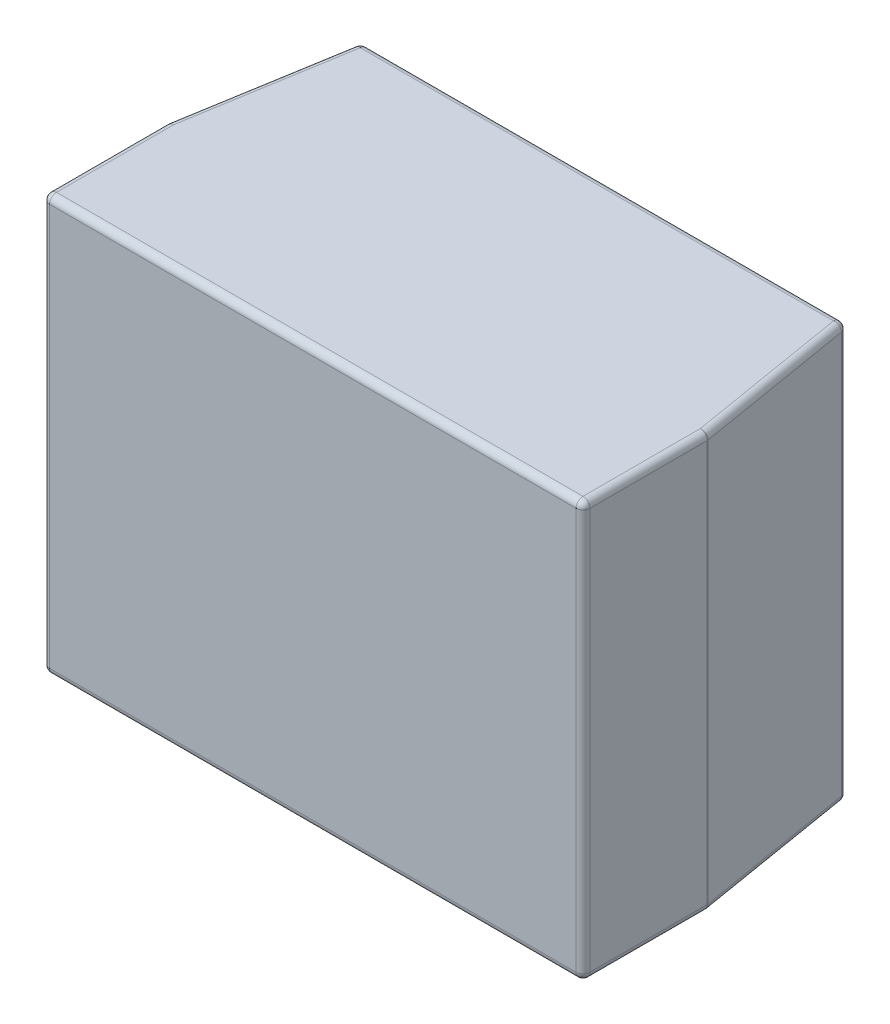
ISO-10303-21;
HEADER;
FILE_DESCRIPTION(('STEP AP214'),'2;1');
FILE_NAME('part.step','',(''),(''),'','','');
FILE_SCHEMA(('AUTOMOTIVE_DESIGN { 1 0 10303 214 1 1 1 1 }'));
ENDSEC;
DATA;
#1=APPLICATION_CONTEXT('core data for automotive mechanical design processes');
#2=APPLICATION_PROTOCOL_DEFINITION('international standard','automotive_design',2000,#1);
#3=PRODUCT_CONTEXT('',#1,'mechanical');
#4=PRODUCT('Part','Part','',(#3));
#5=PRODUCT_RELATED_PRODUCT_CATEGORY('part','',(#4));
#6=PRODUCT_DEFINITION_FORMATION('','',#4);
#7=PRODUCT_DEFINITION_CONTEXT('part definition',#1,'design');
#8=PRODUCT_DEFINITION('design','',#6,#7);
#9=PRODUCT_DEFINITION_SHAPE('','',#8);
#10=(LENGTH_UNIT() NAMED_UNIT(*) SI_UNIT(.MILLI.,.METRE.));
#11=(NAMED_UNIT(*) PLANE_ANGLE_UNIT() SI_UNIT($,.RADIAN.));
#12=(NAMED_UNIT(*) SI_UNIT($,.STERADIAN.) SOLID_ANGLE_UNIT());
#13=UNCERTAINTY_MEASURE_WITH_UNIT(LENGTH_MEASURE(1.E-05),#10,'distance_accuracy_value','');
#14=(GEOMETRIC_REPRESENTATION_CONTEXT(3) GLOBAL_UNCERTAINTY_ASSIGNED_CONTEXT((#13)) GLOBAL_UNIT_ASSIGNED_CONTEXT((#10,
#11,#12)) REPRESENTATION_CONTEXT('',''));
#15=CARTESIAN_POINT('',(0.,0.,0.));
#16=DIRECTION('',(0.,0.,1.));
#17=DIRECTION('',(1.,0.,0.));
#18=AXIS2_PLACEMENT_3D('',#15,#16,#17);
#19=CARTESIAN_POINT('',(0.,0.725,0.125));
#20=DIRECTION('',(-1.,0.,0.));
#21=DIRECTION('',(0.,-1.,0.));
#22=AXIS2_PLACEMENT_3D('',#19,#20,#21);
#23=CYLINDRICAL_SURFACE('',#22,0.025);
#24=CARTESIAN_POINT('',(-0.853821822790423,0.725,0.125));
#25=DIRECTION('',(1.,0.,0.));
#26=DIRECTION('',(0.,0.,1.));
#27=AXIS2_PLACEMENT_3D('',#24,#25,#26);
#28=CIRCLE('',#27,0.025);
#29=CARTESIAN_POINT('',(-0.853821822790423,0.725,0.1));
#30=VERTEX_POINT('',#29);
#31=CARTESIAN_POINT('',(-0.853821822790423,0.75,0.125));
#32=VERTEX_POINT('',#31);
#33=EDGE_CURVE('E27',#30,#32,#28,.T.);
#34=ORIENTED_EDGE('',*,*,#33,.T.);
#35=DIRECTION('',(-1.,0.,0.));
#36=VECTOR('',#35,1.);
#37=CARTESIAN_POINT('',(-0.875,0.75,0.125));
#38=LINE('',#37,#36);
#39=CARTESIAN_POINT('',(0.853821822790424,0.75,0.125));
#40=VERTEX_POINT('',#39);
#41=EDGE_CURVE('E387',#40,#32,#38,.T.);
#42=ORIENTED_EDGE('',*,*,#41,.F.);
#43=CARTESIAN_POINT('',(0.853821822790424,0.725,0.125));
#44=DIRECTION('',(-1.,0.,0.));
#45=DIRECTION('',(0.,1.,0.));
#46=AXIS2_PLACEMENT_3D('',#43,#44,#45);
#47=CIRCLE('',#46,0.025);
#48=CARTESIAN_POINT('',(0.853821822790424,0.725,0.1));
#49=VERTEX_POINT('',#48);
#50=EDGE_CURVE('E11',#40,#49,#47,.T.);
#51=ORIENTED_EDGE('',*,*,#50,.T.);
#52=DIRECTION('',(1.,0.,0.));
#53=VECTOR('',#52,1.);
#54=CARTESIAN_POINT('',(0.875,0.725,0.1));
#55=LINE('',#54,#53);
#56=EDGE_CURVE('E269',#30,#49,#55,.T.);
#57=ORIENTED_EDGE('',*,*,#56,.F.);
#58=EDGE_LOOP('',(#34,#42,#51,#57));
#59=FACE_BOUND('',#58,.T.);
#60=ADVANCED_FACE('F16',(#59),#23,.T.);
#61=CARTESIAN_POINT('',(0.853821822790424,0.725,0.125));
#62=DIRECTION('',(0.,1.,0.));
#63=DIRECTION('',(-1.,0.,0.));
#64=AXIS2_PLACEMENT_3D('',#61,#62,#63);
#65=SPHERICAL_SURFACE('',#64,0.025);
#66=CARTESIAN_POINT('',(0.853821822790424,0.725,0.125));
#67=DIRECTION('',(-0.164398987305357,0.,-0.986393923832144));
#68=DIRECTION('',(-0.986393923832144,0.,0.164398987305357));
#69=AXIS2_PLACEMENT_3D('',#66,#67,#68);
#70=CIRCLE('',#69,0.025);
#71=CARTESIAN_POINT('',(0.878481670886228,0.725,0.120890025317366));
#72=VERTEX_POINT('',#71);
#73=EDGE_CURVE('E361',#40,#72,#70,.T.);
#74=ORIENTED_EDGE('',*,*,#73,.T.);
#75=CARTESIAN_POINT('',(0.853821822790424,0.725,0.125));
#76=DIRECTION('',(0.,1.,0.));
#77=DIRECTION('',(0.,0.,1.));
#78=AXIS2_PLACEMENT_3D('',#75,#76,#77);
#79=CIRCLE('',#78,0.025);
#80=EDGE_CURVE('E358',#72,#49,#79,.T.);
#81=ORIENTED_EDGE('',*,*,#80,.T.);
#82=ORIENTED_EDGE('',*,*,#50,.F.);
#83=EDGE_LOOP('',(#74,#81,#82));
#84=FACE_BOUND('',#83,.T.);
#85=ADVANCED_FACE('F576',(#84),#65,.T.);
#86=CARTESIAN_POINT('',(-0.853821822790423,0.725,0.125));
#87=DIRECTION('',(0.,1.,0.));
#88=DIRECTION('',(-1.,0.,0.));
#89=AXIS2_PLACEMENT_3D('',#86,#87,#88);
#90=SPHERICAL_SURFACE('',#89,0.025);
#91=CARTESIAN_POINT('',(-0.853821822790423,0.725,0.125));
#92=DIRECTION('',(0.,1.,0.));
#93=DIRECTION('',(0.,0.,1.));
#94=AXIS2_PLACEMENT_3D('',#91,#92,#93);
#95=CIRCLE('',#94,0.025);
#96=CARTESIAN_POINT('',(-0.878481670886227,0.725,0.120890025317366));
#97=VERTEX_POINT('',#96);
#98=EDGE_CURVE('E362',#30,#97,#95,.T.);
#99=ORIENTED_EDGE('',*,*,#98,.T.);
#100=CARTESIAN_POINT('',(-0.853821822790423,0.725,0.125));
#101=DIRECTION('',(0.164398987305358,0.,-0.986393923832144));
#102=DIRECTION('',(-0.986393923832144,0.,-0.164398987305358));
#103=AXIS2_PLACEMENT_3D('',#100,#101,#102);
#104=CIRCLE('',#103,0.025);
#105=EDGE_CURVE('E383',#97,#32,#104,.T.);
#106=ORIENTED_EDGE('',*,*,#105,.T.);
#107=ORIENTED_EDGE('',*,*,#33,.F.);
#108=EDGE_LOOP('',(#99,#106,#107));
#109=FACE_BOUND('',#108,.T.);
#110=ADVANCED_FACE('F399',(#109),#90,.T.);
#111=CARTESIAN_POINT('',(0.996961773525818,0.725,0.983839704412364));
#112=DIRECTION('',(-0.164398987305357,0.,-0.986393923832144));
#113=DIRECTION('',(-0.986393923832144,0.,0.164398987305357));
#114=AXIS2_PLACEMENT_3D('',#111,#112,#113);
#115=CYLINDRICAL_SURFACE('',#114,0.025);
#116=CARTESIAN_POINT('',(0.95,0.725,0.702069063257455));
#117=DIRECTION('',(-0.164398987305358,0.,-0.986393923832144));
#118=DIRECTION('',(0.986393923832144,0.,-0.164398987305358));
#119=AXIS2_PLACEMENT_3D('',#116,#117,#118);
#120=CIRCLE('',#119,0.025);
#121=CARTESIAN_POINT('',(0.95,0.75,0.702069063257455));
#122=VERTEX_POINT('',#121);
#123=CARTESIAN_POINT('',(0.974659848095804,0.725,0.697959088574821));
#124=VERTEX_POINT('',#123);
#125=EDGE_CURVE('E161',#122,#124,#120,.T.);
#126=ORIENTED_EDGE('',*,*,#125,.T.);
#127=DIRECTION('',(0.164398987305357,0.,0.986393923832144));
#128=VECTOR('',#127,1.);
#129=CARTESIAN_POINT('',(0.875,0.725,0.1));
#130=LINE('',#129,#128);
#131=EDGE_CURVE('E283',#72,#124,#130,.T.);
#132=ORIENTED_EDGE('',*,*,#131,.F.);
#133=ORIENTED_EDGE('',*,*,#73,.F.);
#134=DIRECTION('',(-0.164398987305357,0.,-0.986393923832144));
#135=VECTOR('',#134,1.);
#136=CARTESIAN_POINT('',(0.996961773525818,0.75,0.983839704412364));
#137=LINE('',#136,#135);
#138=EDGE_CURVE('E392',#122,#40,#137,.T.);
#139=ORIENTED_EDGE('',*,*,#138,.F.);
#140=EDGE_LOOP('',(#126,#132,#133,#139));
#141=FACE_BOUND('',#140,.T.);
#142=ADVANCED_FACE('F589',(#141),#115,.T.);
#143=CARTESIAN_POINT('',(0.853821822790424,0.,0.125));
#144=DIRECTION('',(0.,1.,0.));
#145=DIRECTION('',(0.,0.,1.));
#146=AXIS2_PLACEMENT_3D('',#143,#144,#145);
#147=CYLINDRICAL_SURFACE('',#146,0.025);
#148=CARTESIAN_POINT('',(0.853821822790424,-0.725,0.125));
#149=DIRECTION('',(0.,1.,0.));
#150=DIRECTION('',(0.,0.,-1.));
#151=AXIS2_PLACEMENT_3D('',#148,#149,#150);
#152=CIRCLE('',#151,0.025);
#153=CARTESIAN_POINT('',(0.878481670886228,-0.725,0.120890025317366));
#154=VERTEX_POINT('',#153);
#155=CARTESIAN_POINT('',(0.853821822790424,-0.725,0.1));
#156=VERTEX_POINT('',#155);
#157=EDGE_CURVE('E445',#154,#156,#152,.T.);
#158=ORIENTED_EDGE('',*,*,#157,.T.);
#159=DIRECTION('',(0.,-1.,0.));
#160=VECTOR('',#159,1.);
#161=CARTESIAN_POINT('',(0.853821822790424,-0.75,0.1));
#162=LINE('',#161,#160);
#163=EDGE_CURVE('E272',#49,#156,#162,.T.);
#164=ORIENTED_EDGE('',*,*,#163,.F.);
#165=ORIENTED_EDGE('',*,*,#80,.F.);
#166=DIRECTION('',(0.,1.,0.));
#167=VECTOR('',#166,1.);
#168=CARTESIAN_POINT('',(0.878481670886228,0.75,0.120890025317366));
#169=LINE('',#168,#167);
#170=EDGE_CURVE('E279',#154,#72,#169,.T.);
#171=ORIENTED_EDGE('',*,*,#170,.F.);
#172=EDGE_LOOP('',(#158,#164,#165,#171));
#173=FACE_BOUND('',#172,.T.);
#174=ADVANCED_FACE('F586',(#173),#147,.T.);
#175=CARTESIAN_POINT('',(-0.853821822790423,0.,0.125));
#176=DIRECTION('',(0.,1.,0.));
#177=DIRECTION('',(0.,0.,1.));
#178=AXIS2_PLACEMENT_3D('',#175,#176,#177);
#179=CYLINDRICAL_SURFACE('',#178,0.025);
#180=CARTESIAN_POINT('',(-0.853821822790423,-0.725,0.125));
#181=DIRECTION('',(0.,1.,0.));
#182=DIRECTION('',(0.,0.,-1.));
#183=AXIS2_PLACEMENT_3D('',#180,#181,#182);
#184=CIRCLE('',#183,0.025);
#185=CARTESIAN_POINT('',(-0.853821822790423,-0.725,0.1));
#186=VERTEX_POINT('',#185);
#187=CARTESIAN_POINT('',(-0.878481670886227,-0.725,0.120890025317366));
#188=VERTEX_POINT('',#187);
#189=EDGE_CURVE('E410',#186,#188,#184,.T.);
#190=ORIENTED_EDGE('',*,*,#189,.T.);
#191=DIRECTION('',(0.,-1.,0.));
#192=VECTOR('',#191,1.);
#193=CARTESIAN_POINT('',(-0.878481670886227,-0.75,0.120890025317366));
#194=LINE('',#193,#192);
#195=EDGE_CURVE('E308',#97,#188,#194,.T.);
#196=ORIENTED_EDGE('',*,*,#195,.F.);
#197=ORIENTED_EDGE('',*,*,#98,.F.);
#198=DIRECTION('',(0.,1.,0.));
#199=VECTOR('',#198,1.);
#200=CARTESIAN_POINT('',(-0.853821822790423,0.75,0.1));
#201=LINE('',#200,#199);
#202=EDGE_CURVE('E245',#186,#30,#201,.T.);
#203=ORIENTED_EDGE('',*,*,#202,.F.);
#204=EDGE_LOOP('',(#190,#196,#197,#203));
#205=FACE_BOUND('',#204,.T.);
#206=ADVANCED_FACE('F409',(#205),#179,.T.);
#207=CARTESIAN_POINT('',(-0.996961773525817,0.725,0.983839704412364));
#208=DIRECTION('',(0.164398987305357,0.,-0.986393923832144));
#209=DIRECTION('',(-0.986393923832144,0.,-0.164398987305357));
#210=AXIS2_PLACEMENT_3D('',#207,#208,#209);
#211=CYLINDRICAL_SURFACE('',#210,0.025);
#212=CARTESIAN_POINT('',(-0.95,0.725,0.702069063257456));
#213=DIRECTION('',(0.164398987305383,0.,-0.98639392383214));
#214=DIRECTION('',(0.98639392383214,0.,0.164398987305383));
#215=AXIS2_PLACEMENT_3D('',#212,#213,#214);
#216=CIRCLE('',#215,0.025);
#217=CARTESIAN_POINT('',(-0.974659848095803,0.725,0.697959088574822));
#218=VERTEX_POINT('',#217);
#219=CARTESIAN_POINT('',(-0.95,0.75,0.702069063257456));
#220=VERTEX_POINT('',#219);
#221=EDGE_CURVE('E147',#218,#220,#216,.T.);
#222=ORIENTED_EDGE('',*,*,#221,.T.);
#223=DIRECTION('',(-0.164398987305357,0.,0.986393923832144));
#224=VECTOR('',#223,1.);
#225=CARTESIAN_POINT('',(-0.996961773525817,0.75,0.983839704412364));
#226=LINE('',#225,#224);
#227=EDGE_CURVE('E391',#32,#220,#226,.T.);
#228=ORIENTED_EDGE('',*,*,#227,.F.);
#229=ORIENTED_EDGE('',*,*,#105,.F.);
#230=DIRECTION('',(0.164398987305357,0.,-0.986393923832144));
#231=VECTOR('',#230,1.);
#232=CARTESIAN_POINT('',(-0.975,0.725,0.7));
#233=LINE('',#232,#231);
#234=EDGE_CURVE('E329',#218,#97,#233,.T.);
#235=ORIENTED_EDGE('',*,*,#234,.F.);
#236=EDGE_LOOP('',(#222,#228,#229,#235));
#237=FACE_BOUND('',#236,.T.);
#238=ADVANCED_FACE('F407',(#237),#211,.T.);
#239=CARTESIAN_POINT('',(0.95,0.725,0.702069063257456));
#240=DIRECTION('',(0.,1.,0.));
#241=DIRECTION('',(0.,0.,1.));
#242=AXIS2_PLACEMENT_3D('',#239,#240,#241);
#243=SPHERICAL_SURFACE('',#242,0.025);
#244=CARTESIAN_POINT('',(0.95,0.725,0.702069063257455));
#245=DIRECTION('',(0.,0.,-1.));
#246=DIRECTION('',(-1.,0.,0.));
#247=AXIS2_PLACEMENT_3D('',#244,#245,#246);
#248=CIRCLE('',#247,0.025);
#249=CARTESIAN_POINT('',(0.975,0.725,0.702069063257455));
#250=VERTEX_POINT('',#249);
#251=EDGE_CURVE('E259',#122,#250,#248,.T.);
#252=ORIENTED_EDGE('',*,*,#251,.T.);
#253=CARTESIAN_POINT('',(0.95,0.725,0.702069063257455));
#254=DIRECTION('',(0.,1.,0.));
#255=DIRECTION('',(0.,0.,1.));
#256=AXIS2_PLACEMENT_3D('',#253,#254,#255);
#257=CIRCLE('',#256,0.025);
#258=EDGE_CURVE('E454',#250,#124,#257,.T.);
#259=ORIENTED_EDGE('',*,*,#258,.T.);
#260=ORIENTED_EDGE('',*,*,#125,.F.);
#261=EDGE_LOOP('',(#252,#259,#260));
#262=FACE_BOUND('',#261,.T.);
#263=ADVANCED_FACE('F552',(#262),#243,.T.);
#264=CARTESIAN_POINT('',(0.853821822790424,-0.725,0.125));
#265=DIRECTION('',(0.,-1.,0.));
#266=DIRECTION('',(0.,0.,-1.));
#267=AXIS2_PLACEMENT_3D('',#264,#265,#266);
#268=SPHERICAL_SURFACE('',#267,0.025);
#269=CARTESIAN_POINT('',(0.853821822790424,-0.725,0.125));
#270=DIRECTION('',(-0.164398987305358,0.,-0.986393923832144));
#271=DIRECTION('',(-0.986393923832144,0.,0.164398987305358));
#272=AXIS2_PLACEMENT_3D('',#269,#270,#271);
#273=CIRCLE('',#272,0.025);
#274=CARTESIAN_POINT('',(0.853821822790424,-0.75,0.125));
#275=VERTEX_POINT('',#274);
#276=EDGE_CURVE('E456',#154,#275,#273,.T.);
#277=ORIENTED_EDGE('',*,*,#276,.T.);
#278=CARTESIAN_POINT('',(0.853821822790424,-0.725,0.125));
#279=DIRECTION('',(1.,0.,0.));
#280=DIRECTION('',(0.,0.,-1.));
#281=AXIS2_PLACEMENT_3D('',#278,#279,#280);
#282=CIRCLE('',#281,0.025);
#283=EDGE_CURVE('E357',#275,#156,#282,.T.);
#284=ORIENTED_EDGE('',*,*,#283,.T.);
#285=ORIENTED_EDGE('',*,*,#157,.F.);
#286=EDGE_LOOP('',(#277,#284,#285));
#287=FACE_BOUND('',#286,.T.);
#288=ADVANCED_FACE('F591',(#287),#268,.T.);
#289=CARTESIAN_POINT('',(-0.853821822790423,-0.725,0.125));
#290=DIRECTION('',(0.,-1.,0.));
#291=DIRECTION('',(0.,0.,-1.));
#292=AXIS2_PLACEMENT_3D('',#289,#290,#291);
#293=SPHERICAL_SURFACE('',#292,0.025);
#294=CARTESIAN_POINT('',(-0.853821822790423,-0.725,0.125));
#295=DIRECTION('',(-1.,0.,0.));
#296=DIRECTION('',(0.,-1.,0.));
#297=AXIS2_PLACEMENT_3D('',#294,#295,#296);
#298=CIRCLE('',#297,0.025);
#299=CARTESIAN_POINT('',(-0.853821822790423,-0.75,0.125));
#300=VERTEX_POINT('',#299);
#301=EDGE_CURVE('E200',#186,#300,#298,.T.);
#302=ORIENTED_EDGE('',*,*,#301,.T.);
#303=CARTESIAN_POINT('',(-0.853821822790423,-0.725,0.125));
#304=DIRECTION('',(0.164398987305354,0.,-0.986393923832144));
#305=DIRECTION('',(-0.986393923832144,0.,-0.164398987305354));
#306=AXIS2_PLACEMENT_3D('',#303,#304,#305);
#307=CIRCLE('',#306,0.025);
#308=EDGE_CURVE('E348',#300,#188,#307,.T.);
#309=ORIENTED_EDGE('',*,*,#308,.T.);
#310=ORIENTED_EDGE('',*,*,#189,.F.);
#311=EDGE_LOOP('',(#302,#309,#310));
#312=FACE_BOUND('',#311,.T.);
#313=ADVANCED_FACE('F594',(#312),#293,.T.);
#314=CARTESIAN_POINT('',(-0.95,0.725,0.702069063257456));
#315=DIRECTION('',(0.,1.,0.));
#316=DIRECTION('',(0.,0.,1.));
#317=AXIS2_PLACEMENT_3D('',#314,#315,#316);
#318=SPHERICAL_SURFACE('',#317,0.025);
#319=CARTESIAN_POINT('',(-0.95,0.725,0.702069063257456));
#320=DIRECTION('',(0.,1.,0.));
#321=DIRECTION('',(0.,0.,1.));
#322=AXIS2_PLACEMENT_3D('',#319,#320,#321);
#323=CIRCLE('',#322,0.025);
#324=CARTESIAN_POINT('',(-0.975,0.725,0.702069063257456));
#325=VERTEX_POINT('',#324);
#326=EDGE_CURVE('E345',#218,#325,#323,.T.);
#327=ORIENTED_EDGE('',*,*,#326,.T.);
#328=CARTESIAN_POINT('',(-0.95,0.725,0.702069063257456));
#329=DIRECTION('',(0.,0.,-1.));
#330=DIRECTION('',(0.,1.,0.));
#331=AXIS2_PLACEMENT_3D('',#328,#329,#330);
#332=CIRCLE('',#331,0.025);
#333=EDGE_CURVE('E324',#325,#220,#332,.T.);
#334=ORIENTED_EDGE('',*,*,#333,.T.);
#335=ORIENTED_EDGE('',*,*,#221,.F.);
#336=EDGE_LOOP('',(#327,#334,#335));
#337=FACE_BOUND('',#336,.T.);
#338=ADVANCED_FACE('F422',(#337),#318,.T.);
#339=CARTESIAN_POINT('',(0.95,0.725,1.15));
#340=DIRECTION('',(0.,0.,-1.));
#341=DIRECTION('',(-1.,0.,0.));
#342=AXIS2_PLACEMENT_3D('',#339,#340,#341);
#343=CYLINDRICAL_SURFACE('',#342,0.025);
#344=CARTESIAN_POINT('',(0.95,0.725,1.125));
#345=DIRECTION('',(0.,0.,-1.));
#346=DIRECTION('',(1.,0.,0.));
#347=AXIS2_PLACEMENT_3D('',#344,#345,#346);
#348=CIRCLE('',#347,0.025);
#349=CARTESIAN_POINT('',(0.95,0.75,1.125));
#350=VERTEX_POINT('',#349);
#351=CARTESIAN_POINT('',(0.975,0.725,1.125));
#352=VERTEX_POINT('',#351);
#353=EDGE_CURVE('E221',#350,#352,#348,.T.);
#354=ORIENTED_EDGE('',*,*,#353,.T.);
#355=DIRECTION('',(0.,0.,1.));
#356=VECTOR('',#355,1.);
#357=CARTESIAN_POINT('',(0.975,0.725,1.15));
#358=LINE('',#357,#356);
#359=EDGE_CURVE('E267',#250,#352,#358,.T.);
#360=ORIENTED_EDGE('',*,*,#359,.F.);
#361=ORIENTED_EDGE('',*,*,#251,.F.);
#362=DIRECTION('',(0.,0.,-1.));
#363=VECTOR('',#362,1.);
#364=CARTESIAN_POINT('',(0.95,0.75,1.15));
#365=LINE('',#364,#363);
#366=EDGE_CURVE('E290',#350,#122,#365,.T.);
#367=ORIENTED_EDGE('',*,*,#366,.F.);
#368=EDGE_LOOP('',(#354,#360,#361,#367));
#369=FACE_BOUND('',#368,.T.);
#370=ADVANCED_FACE('F559',(#369),#343,.T.);
#371=CARTESIAN_POINT('',(0.95,0.,0.702069063257455));
#372=DIRECTION('',(0.,1.,0.));
#373=DIRECTION('',(0.,0.,1.));
#374=AXIS2_PLACEMENT_3D('',#371,#372,#373);
#375=CYLINDRICAL_SURFACE('',#374,0.025);
#376=CARTESIAN_POINT('',(0.95,-0.725,0.702069063257455));
#377=DIRECTION('',(0.,1.,0.));
#378=DIRECTION('',(0.,0.,-1.));
#379=AXIS2_PLACEMENT_3D('',#376,#377,#378);
#380=CIRCLE('',#379,0.025);
#381=CARTESIAN_POINT('',(0.975,-0.725,0.702069063257455));
#382=VERTEX_POINT('',#381);
#383=CARTESIAN_POINT('',(0.974659848095804,-0.725,0.697959088574821));
#384=VERTEX_POINT('',#383);
#385=EDGE_CURVE('E365',#382,#384,#380,.T.);
#386=ORIENTED_EDGE('',*,*,#385,.T.);
#387=DIRECTION('',(0.,-1.,0.));
#388=VECTOR('',#387,1.);
#389=CARTESIAN_POINT('',(0.974659848095804,0.,0.697959088574821));
#390=LINE('',#389,#388);
#391=EDGE_CURVE('E333',#124,#384,#390,.T.);
#392=ORIENTED_EDGE('',*,*,#391,.F.);
#393=ORIENTED_EDGE('',*,*,#258,.F.);
#394=DIRECTION('',(0.,1.,0.));
#395=VECTOR('',#394,1.);
#396=CARTESIAN_POINT('',(0.975,0.,0.702069063257455));
#397=LINE('',#396,#395);
#398=EDGE_CURVE('E263',#382,#250,#397,.T.);
#399=ORIENTED_EDGE('',*,*,#398,.F.);
#400=EDGE_LOOP('',(#386,#392,#393,#399));
#401=FACE_BOUND('',#400,.T.);
#402=ADVANCED_FACE('F558',(#401),#375,.T.);
#403=CARTESIAN_POINT('',(0.996961773525818,-0.725,0.983839704412364));
#404=DIRECTION('',(-0.164398987305357,0.,-0.986393923832144));
#405=DIRECTION('',(-0.986393923832144,0.,0.164398987305357));
#406=AXIS2_PLACEMENT_3D('',#403,#404,#405);
#407=CYLINDRICAL_SURFACE('',#406,0.025);
#408=CARTESIAN_POINT('',(0.95,-0.725,0.702069063257455));
#409=DIRECTION('',(-0.164398987305362,0.,-0.986393923832143));
#410=DIRECTION('',(0.986393923832143,0.,-0.164398987305362));
#411=AXIS2_PLACEMENT_3D('',#408,#409,#410);
#412=CIRCLE('',#411,0.025);
#413=CARTESIAN_POINT('',(0.95,-0.75,0.702069063257455));
#414=VERTEX_POINT('',#413);
#415=EDGE_CURVE('E325',#384,#414,#412,.T.);
#416=ORIENTED_EDGE('',*,*,#415,.T.);
#417=DIRECTION('',(0.164398987305357,0.,0.986393923832144));
#418=VECTOR('',#417,1.);
#419=CARTESIAN_POINT('',(0.950340151904196,-0.75,0.704109974682634));
#420=LINE('',#419,#418);
#421=EDGE_CURVE('E291',#275,#414,#420,.T.);
#422=ORIENTED_EDGE('',*,*,#421,.F.);
#423=ORIENTED_EDGE('',*,*,#276,.F.);
#424=DIRECTION('',(-0.164398987305357,0.,-0.986393923832144));
#425=VECTOR('',#424,1.);
#426=CARTESIAN_POINT('',(0.875,-0.725,0.1));
#427=LINE('',#426,#425);
#428=EDGE_CURVE('E284',#384,#154,#427,.T.);
#429=ORIENTED_EDGE('',*,*,#428,.F.);
#430=EDGE_LOOP('',(#416,#422,#423,#429));
#431=FACE_BOUND('',#430,.T.);
#432=ADVANCED_FACE('F518',(#431),#407,.T.);
#433=CARTESIAN_POINT('',(0.,-0.725,0.125));
#434=DIRECTION('',(1.,0.,0.));
#435=DIRECTION('',(0.,1.,0.));
#436=AXIS2_PLACEMENT_3D('',#433,#434,#435);
#437=CYLINDRICAL_SURFACE('',#436,0.025);
#438=ORIENTED_EDGE('',*,*,#283,.F.);
#439=DIRECTION('',(1.,0.,0.));
#440=VECTOR('',#439,1.);
#441=CARTESIAN_POINT('',(0.,-0.75,0.125));
#442=LINE('',#441,#440);
#443=EDGE_CURVE('E295',#300,#275,#442,.T.);
#444=ORIENTED_EDGE('',*,*,#443,.F.);
#445=ORIENTED_EDGE('',*,*,#301,.F.);
#446=DIRECTION('',(-1.,0.,0.));
#447=VECTOR('',#446,1.);
#448=CARTESIAN_POINT('',(0.,-0.725,0.1));
#449=LINE('',#448,#447);
#450=EDGE_CURVE('E302',#156,#186,#449,.T.);
#451=ORIENTED_EDGE('',*,*,#450,.F.);
#452=EDGE_LOOP('',(#438,#444,#445,#451));
#453=FACE_BOUND('',#452,.T.);
#454=ADVANCED_FACE('F513',(#453),#437,.T.);
#455=CARTESIAN_POINT('',(-0.996961773525817,-0.725,0.983839704412364));
#456=DIRECTION('',(0.164398987305357,0.,-0.986393923832144));
#457=DIRECTION('',(-0.986393923832144,0.,-0.164398987305357));
#458=AXIS2_PLACEMENT_3D('',#455,#456,#457);
#459=CYLINDRICAL_SURFACE('',#458,0.025);
#460=CARTESIAN_POINT('',(-0.95,-0.725,0.702069063257456));
#461=DIRECTION('',(0.164398987305358,0.,-0.986393923832144));
#462=DIRECTION('',(0.986393923832144,0.,0.164398987305358));
#463=AXIS2_PLACEMENT_3D('',#460,#461,#462);
#464=CIRCLE('',#463,0.025);
#465=CARTESIAN_POINT('',(-0.95,-0.75,0.702069063257455));
#466=VERTEX_POINT('',#465);
#467=CARTESIAN_POINT('',(-0.974659848095803,-0.725,0.697959088574822));
#468=VERTEX_POINT('',#467);
#469=EDGE_CURVE('E206',#466,#468,#464,.T.);
#470=ORIENTED_EDGE('',*,*,#469,.T.);
#471=DIRECTION('',(-0.164398987305357,0.,0.986393923832144));
#472=VECTOR('',#471,1.);
#473=CARTESIAN_POINT('',(-0.975,-0.725,0.7));
#474=LINE('',#473,#472);
#475=EDGE_CURVE('E303',#188,#468,#474,.T.);
#476=ORIENTED_EDGE('',*,*,#475,.F.);
#477=ORIENTED_EDGE('',*,*,#308,.F.);
#478=DIRECTION('',(0.164398987305357,0.,-0.986393923832144));
#479=VECTOR('',#478,1.);
#480=CARTESIAN_POINT('',(-0.850340151904196,-0.75,0.104109974682634));
#481=LINE('',#480,#479);
#482=EDGE_CURVE('E337',#466,#300,#481,.T.);
#483=ORIENTED_EDGE('',*,*,#482,.F.);
#484=EDGE_LOOP('',(#470,#476,#477,#483));
#485=FACE_BOUND('',#484,.T.);
#486=ADVANCED_FACE('F509',(#485),#459,.T.);
#487=CARTESIAN_POINT('',(-0.95,0.,0.702069063257456));
#488=DIRECTION('',(0.,-1.,0.));
#489=DIRECTION('',(0.,0.,-1.));
#490=AXIS2_PLACEMENT_3D('',#487,#488,#489);
#491=CYLINDRICAL_SURFACE('',#490,0.025);
#492=CARTESIAN_POINT('',(-0.95,-0.725,0.702069063257456));
#493=DIRECTION('',(0.,1.,0.));
#494=DIRECTION('',(0.,0.,-1.));
#495=AXIS2_PLACEMENT_3D('',#492,#493,#494);
#496=CIRCLE('',#495,0.025);
#497=CARTESIAN_POINT('',(-0.975,-0.725,0.702069063257456));
#498=VERTEX_POINT('',#497);
#499=EDGE_CURVE('E20',#468,#498,#496,.T.);
#500=ORIENTED_EDGE('',*,*,#499,.T.);
#501=DIRECTION('',(0.,-1.,0.));
#502=VECTOR('',#501,1.);
#503=CARTESIAN_POINT('',(-0.975,-0.75,0.702069063257456));
#504=LINE('',#503,#502);
#505=EDGE_CURVE('E419',#325,#498,#504,.T.);
#506=ORIENTED_EDGE('',*,*,#505,.F.);
#507=ORIENTED_EDGE('',*,*,#326,.F.);
#508=DIRECTION('',(0.,1.,0.));
#509=VECTOR('',#508,1.);
#510=CARTESIAN_POINT('',(-0.974659848095803,0.75,0.697959088574822));
#511=LINE('',#510,#509);
#512=EDGE_CURVE('E307',#468,#218,#511,.T.);
#513=ORIENTED_EDGE('',*,*,#512,.F.);
#514=EDGE_LOOP('',(#500,#506,#507,#513));
#515=FACE_BOUND('',#514,.T.);
#516=ADVANCED_FACE('F416',(#515),#491,.T.);
#517=CARTESIAN_POINT('',(-0.95,0.725,1.15));
#518=DIRECTION('',(0.,0.,1.));
#519=DIRECTION('',(1.,0.,0.));
#520=AXIS2_PLACEMENT_3D('',#517,#518,#519);
#521=CYLINDRICAL_SURFACE('',#520,0.025);
#522=CARTESIAN_POINT('',(-0.95,0.725,1.125));
#523=DIRECTION('',(0.,0.,-1.));
#524=DIRECTION('',(1.,0.,0.));
#525=AXIS2_PLACEMENT_3D('',#522,#523,#524);
#526=CIRCLE('',#525,0.025);
#527=CARTESIAN_POINT('',(-0.975,0.725,1.125));
#528=VERTEX_POINT('',#527);
#529=CARTESIAN_POINT('',(-0.95,0.75,1.125));
#530=VERTEX_POINT('',#529);
#531=EDGE_CURVE('E224',#528,#530,#526,.T.);
#532=ORIENTED_EDGE('',*,*,#531,.T.);
#533=DIRECTION('',(0.,0.,1.));
#534=VECTOR('',#533,1.);
#535=CARTESIAN_POINT('',(-0.95,0.75,1.15));
#536=LINE('',#535,#534);
#537=EDGE_CURVE('E321',#220,#530,#536,.T.);
#538=ORIENTED_EDGE('',*,*,#537,.F.);
#539=ORIENTED_EDGE('',*,*,#333,.F.);
#540=DIRECTION('',(0.,0.,-1.));
#541=VECTOR('',#540,1.);
#542=CARTESIAN_POINT('',(-0.975,0.725,0.7));
#543=LINE('',#542,#541);
#544=EDGE_CURVE('E289',#528,#325,#543,.T.);
#545=ORIENTED_EDGE('',*,*,#544,.F.);
#546=EDGE_LOOP('',(#532,#538,#539,#545));
#547=FACE_BOUND('',#546,.T.);
#548=ADVANCED_FACE('F426',(#547),#521,.T.);
#549=CARTESIAN_POINT('',(0.95,0.725,1.125));
#550=DIRECTION('',(0.,0.,1.));
#551=DIRECTION('',(1.,0.,0.));
#552=AXIS2_PLACEMENT_3D('',#549,#550,#551);
#553=SPHERICAL_SURFACE('',#552,0.025);
#554=CARTESIAN_POINT('',(0.95,0.725,1.125));
#555=DIRECTION('',(1.,0.,0.));
#556=DIRECTION('',(0.,0.,-1.));
#557=AXIS2_PLACEMENT_3D('',#554,#555,#556);
#558=CIRCLE('',#557,0.025);
#559=CARTESIAN_POINT('',(0.95,0.725,1.15));
#560=VERTEX_POINT('',#559);
#561=EDGE_CURVE('E216',#350,#560,#558,.T.);
#562=ORIENTED_EDGE('',*,*,#561,.T.);
#563=CARTESIAN_POINT('',(0.95,0.725,1.125));
#564=DIRECTION('',(0.,1.,0.));
#565=DIRECTION('',(0.,0.,1.));
#566=AXIS2_PLACEMENT_3D('',#563,#564,#565);
#567=CIRCLE('',#566,0.025);
#568=EDGE_CURVE('E219',#560,#352,#567,.T.);
#569=ORIENTED_EDGE('',*,*,#568,.T.);
#570=ORIENTED_EDGE('',*,*,#353,.F.);
#571=EDGE_LOOP('',(#562,#569,#570));
#572=FACE_BOUND('',#571,.T.);
#573=ADVANCED_FACE('F218',(#572),#553,.T.);
#574=CARTESIAN_POINT('',(0.95,-0.725,0.702069063257455));
#575=DIRECTION('',(0.,-1.,0.));
#576=DIRECTION('',(0.,0.,-1.));
#577=AXIS2_PLACEMENT_3D('',#574,#575,#576);
#578=SPHERICAL_SURFACE('',#577,0.025);
#579=ORIENTED_EDGE('',*,*,#385,.F.);
#580=CARTESIAN_POINT('',(0.95,-0.725,0.702069063257455));
#581=DIRECTION('',(0.,0.,-1.));
#582=DIRECTION('',(0.,1.,0.));
#583=AXIS2_PLACEMENT_3D('',#580,#581,#582);
#584=CIRCLE('',#583,0.025);
#585=EDGE_CURVE('E236',#382,#414,#584,.T.);
#586=ORIENTED_EDGE('',*,*,#585,.T.);
#587=ORIENTED_EDGE('',*,*,#415,.F.);
#588=EDGE_LOOP('',(#579,#586,#587));
#589=FACE_BOUND('',#588,.T.);
#590=ADVANCED_FACE('F523',(#589),#578,.T.);
#591=CARTESIAN_POINT('',(-0.95,-0.725,0.702069063257456));
#592=DIRECTION('',(0.,-1.,0.));
#593=DIRECTION('',(0.,0.,-1.));
#594=AXIS2_PLACEMENT_3D('',#591,#592,#593);
#595=SPHERICAL_SURFACE('',#594,0.025);
#596=ORIENTED_EDGE('',*,*,#469,.F.);
#597=CARTESIAN_POINT('',(-0.95,-0.725,0.702069063257455));
#598=DIRECTION('',(0.,0.,-1.));
#599=DIRECTION('',(-1.,0.,0.));
#600=AXIS2_PLACEMENT_3D('',#597,#598,#599);
#601=CIRCLE('',#600,0.025);
#602=EDGE_CURVE('E370',#466,#498,#601,.T.);
#603=ORIENTED_EDGE('',*,*,#602,.T.);
#604=ORIENTED_EDGE('',*,*,#499,.F.);
#605=EDGE_LOOP('',(#596,#603,#604));
#606=FACE_BOUND('',#605,.T.);
#607=ADVANCED_FACE('F611',(#606),#595,.T.);
#608=CARTESIAN_POINT('',(-0.95,0.725,1.125));
#609=DIRECTION('',(0.,0.,1.));
#610=DIRECTION('',(1.,0.,0.));
#611=AXIS2_PLACEMENT_3D('',#608,#609,#610);
#612=SPHERICAL_SURFACE('',#611,0.025);
#613=CARTESIAN_POINT('',(-0.95,0.725,1.125));
#614=DIRECTION('',(0.,1.,0.));
#615=DIRECTION('',(0.,0.,1.));
#616=AXIS2_PLACEMENT_3D('',#613,#614,#615);
#617=CIRCLE('',#616,0.025);
#618=CARTESIAN_POINT('',(-0.95,0.725,1.15));
#619=VERTEX_POINT('',#618);
#620=EDGE_CURVE('E315',#528,#619,#617,.T.);
#621=ORIENTED_EDGE('',*,*,#620,.T.);
#622=CARTESIAN_POINT('',(-0.95,0.725,1.125));
#623=DIRECTION('',(-1.,0.,0.));
#624=DIRECTION('',(0.,0.,1.));
#625=AXIS2_PLACEMENT_3D('',#622,#623,#624);
#626=CIRCLE('',#625,0.025);
#627=EDGE_CURVE('E111',#619,#530,#626,.T.);
#628=ORIENTED_EDGE('',*,*,#627,.T.);
#629=ORIENTED_EDGE('',*,*,#531,.F.);
#630=EDGE_LOOP('',(#621,#628,#629));
#631=FACE_BOUND('',#630,.T.);
#632=ADVANCED_FACE('F613',(#631),#612,.T.);
#633=CARTESIAN_POINT('',(0.,0.725,1.125));
#634=DIRECTION('',(1.,0.,0.));
#635=DIRECTION('',(0.,1.,0.));
#636=AXIS2_PLACEMENT_3D('',#633,#634,#635);
#637=CYLINDRICAL_SURFACE('',#636,0.025);
#638=ORIENTED_EDGE('',*,*,#627,.F.);
#639=DIRECTION('',(-1.,0.,0.));
#640=VECTOR('',#639,1.);
#641=CARTESIAN_POINT('',(0.,0.725,1.15));
#642=LINE('',#641,#640);
#643=EDGE_CURVE('E239',#560,#619,#642,.T.);
#644=ORIENTED_EDGE('',*,*,#643,.F.);
#645=ORIENTED_EDGE('',*,*,#561,.F.);
#646=DIRECTION('',(1.,0.,0.));
#647=VECTOR('',#646,1.);
#648=CARTESIAN_POINT('',(0.,0.75,1.125));
#649=LINE('',#648,#647);
#650=EDGE_CURVE('E317',#530,#350,#649,.T.);
#651=ORIENTED_EDGE('',*,*,#650,.F.);
#652=EDGE_LOOP('',(#638,#644,#645,#651));
#653=FACE_BOUND('',#652,.T.);
#654=ADVANCED_FACE('F240',(#653),#637,.T.);
#655=CARTESIAN_POINT('',(0.95,0.,1.125));
#656=DIRECTION('',(0.,-1.,0.));
#657=DIRECTION('',(0.,0.,-1.));
#658=AXIS2_PLACEMENT_3D('',#655,#656,#657);
#659=CYLINDRICAL_SURFACE('',#658,0.025);
#660=CARTESIAN_POINT('',(0.95,-0.725,1.125));
#661=DIRECTION('',(0.,1.,0.));
#662=DIRECTION('',(0.,0.,-1.));
#663=AXIS2_PLACEMENT_3D('',#660,#661,#662);
#664=CIRCLE('',#663,0.025);
#665=CARTESIAN_POINT('',(0.95,-0.725,1.15));
#666=VERTEX_POINT('',#665);
#667=CARTESIAN_POINT('',(0.975,-0.725,1.125));
#668=VERTEX_POINT('',#667);
#669=EDGE_CURVE('E316',#666,#668,#664,.T.);
#670=ORIENTED_EDGE('',*,*,#669,.T.);
#671=DIRECTION('',(0.,-1.,0.));
#672=VECTOR('',#671,1.);
#673=CARTESIAN_POINT('',(0.975,0.,1.125));
#674=LINE('',#673,#672);
#675=EDGE_CURVE('E233',#352,#668,#674,.T.);
#676=ORIENTED_EDGE('',*,*,#675,.F.);
#677=ORIENTED_EDGE('',*,*,#568,.F.);
#678=DIRECTION('',(0.,1.,0.));
#679=VECTOR('',#678,1.);
#680=CARTESIAN_POINT('',(0.95,0.,1.15));
#681=LINE('',#680,#679);
#682=EDGE_CURVE('E230',#666,#560,#681,.T.);
#683=ORIENTED_EDGE('',*,*,#682,.F.);
#684=EDGE_LOOP('',(#670,#676,#677,#683));
#685=FACE_BOUND('',#684,.T.);
#686=ADVANCED_FACE('F228',(#685),#659,.T.);
#687=CARTESIAN_POINT('',(0.95,-0.725,1.15));
#688=DIRECTION('',(0.,0.,1.));
#689=DIRECTION('',(1.,0.,0.));
#690=AXIS2_PLACEMENT_3D('',#687,#688,#689);
#691=CYLINDRICAL_SURFACE('',#690,0.025);
#692=CARTESIAN_POINT('',(0.95,-0.725,1.125));
#693=DIRECTION('',(0.,0.,-1.));
#694=DIRECTION('',(1.,0.,0.));
#695=AXIS2_PLACEMENT_3D('',#692,#693,#694);
#696=CIRCLE('',#695,0.025);
#697=CARTESIAN_POINT('',(0.95,-0.75,1.125));
#698=VERTEX_POINT('',#697);
#699=EDGE_CURVE('E125',#668,#698,#696,.T.);
#700=ORIENTED_EDGE('',*,*,#699,.T.);
#701=DIRECTION('',(0.,0.,1.));
#702=VECTOR('',#701,1.);
#703=CARTESIAN_POINT('',(0.95,-0.75,1.15));
#704=LINE('',#703,#702);
#705=EDGE_CURVE('E278',#414,#698,#704,.T.);
#706=ORIENTED_EDGE('',*,*,#705,.F.);
#707=ORIENTED_EDGE('',*,*,#585,.F.);
#708=DIRECTION('',(0.,0.,-1.));
#709=VECTOR('',#708,1.);
#710=CARTESIAN_POINT('',(0.975,-0.725,0.7));
#711=LINE('',#710,#709);
#712=EDGE_CURVE('E298',#668,#382,#711,.T.);
#713=ORIENTED_EDGE('',*,*,#712,.F.);
#714=EDGE_LOOP('',(#700,#706,#707,#713));
#715=FACE_BOUND('',#714,.T.);
#716=ADVANCED_FACE('F492',(#715),#691,.T.);
#717=CARTESIAN_POINT('',(-0.95,-0.725,1.15));
#718=DIRECTION('',(0.,0.,-1.));
#719=DIRECTION('',(-1.,0.,0.));
#720=AXIS2_PLACEMENT_3D('',#717,#718,#719);
#721=CYLINDRICAL_SURFACE('',#720,0.025);
#722=CARTESIAN_POINT('',(-0.95,-0.725,1.125));
#723=DIRECTION('',(0.,0.,-1.));
#724=DIRECTION('',(1.,0.,0.));
#725=AXIS2_PLACEMENT_3D('',#722,#723,#724);
#726=CIRCLE('',#725,0.025);
#727=CARTESIAN_POINT('',(-0.95,-0.75,1.125));
#728=VERTEX_POINT('',#727);
#729=CARTESIAN_POINT('',(-0.975,-0.725,1.125));
#730=VERTEX_POINT('',#729);
#731=EDGE_CURVE('E344',#728,#730,#726,.T.);
#732=ORIENTED_EDGE('',*,*,#731,.T.);
#733=DIRECTION('',(0.,0.,1.));
#734=VECTOR('',#733,1.);
#735=CARTESIAN_POINT('',(-0.975,-0.725,1.15));
#736=LINE('',#735,#734);
#737=EDGE_CURVE('E462',#498,#730,#736,.T.);
#738=ORIENTED_EDGE('',*,*,#737,.F.);
#739=ORIENTED_EDGE('',*,*,#602,.F.);
#740=DIRECTION('',(0.,0.,-1.));
#741=VECTOR('',#740,1.);
#742=CARTESIAN_POINT('',(-0.95,-0.75,1.15));
#743=LINE('',#742,#741);
#744=EDGE_CURVE('E268',#728,#466,#743,.T.);
#745=ORIENTED_EDGE('',*,*,#744,.F.);
#746=EDGE_LOOP('',(#732,#738,#739,#745));
#747=FACE_BOUND('',#746,.T.);
#748=ADVANCED_FACE('F505',(#747),#721,.T.);
#749=CARTESIAN_POINT('',(-0.95,0.,1.125));
#750=DIRECTION('',(0.,1.,0.));
#751=DIRECTION('',(0.,0.,1.));
#752=AXIS2_PLACEMENT_3D('',#749,#750,#751);
#753=CYLINDRICAL_SURFACE('',#752,0.025);
#754=CARTESIAN_POINT('',(-0.95,-0.725,1.125));
#755=DIRECTION('',(0.,1.,0.));
#756=DIRECTION('',(0.,0.,-1.));
#757=AXIS2_PLACEMENT_3D('',#754,#755,#756);
#758=CIRCLE('',#757,0.025);
#759=CARTESIAN_POINT('',(-0.95,-0.725,1.15));
#760=VERTEX_POINT('',#759);
#761=EDGE_CURVE('E369',#730,#760,#758,.T.);
#762=ORIENTED_EDGE('',*,*,#761,.T.);
#763=DIRECTION('',(0.,-1.,0.));
#764=VECTOR('',#763,1.);
#765=CARTESIAN_POINT('',(-0.95,-0.75,1.15));
#766=LINE('',#765,#764);
#767=EDGE_CURVE('E256',#619,#760,#766,.T.);
#768=ORIENTED_EDGE('',*,*,#767,.F.);
#769=ORIENTED_EDGE('',*,*,#620,.F.);
#770=DIRECTION('',(0.,1.,0.));
#771=VECTOR('',#770,1.);
#772=CARTESIAN_POINT('',(-0.975,0.75,1.125));
#773=LINE('',#772,#771);
#774=EDGE_CURVE('E285',#730,#528,#773,.T.);
#775=ORIENTED_EDGE('',*,*,#774,.F.);
#776=EDGE_LOOP('',(#762,#768,#769,#775));
#777=FACE_BOUND('',#776,.T.);
#778=ADVANCED_FACE('F18',(#777),#753,.T.);
#779=CARTESIAN_POINT('',(0.95,-0.725,1.125));
#780=DIRECTION('',(0.,-1.,0.));
#781=DIRECTION('',(0.,0.,-1.));
#782=AXIS2_PLACEMENT_3D('',#779,#780,#781);
#783=SPHERICAL_SURFACE('',#782,0.025);
#784=ORIENTED_EDGE('',*,*,#669,.F.);
#785=CARTESIAN_POINT('',(0.95,-0.725,1.125));
#786=DIRECTION('',(1.,0.,0.));
#787=DIRECTION('',(0.,0.,-1.));
#788=AXIS2_PLACEMENT_3D('',#785,#786,#787);
#789=CIRCLE('',#788,0.025);
#790=EDGE_CURVE('E341',#666,#698,#789,.T.);
#791=ORIENTED_EDGE('',*,*,#790,.T.);
#792=ORIENTED_EDGE('',*,*,#699,.F.);
#793=EDGE_LOOP('',(#784,#791,#792));
#794=FACE_BOUND('',#793,.T.);
#795=ADVANCED_FACE('F496',(#794),#783,.T.);
#796=CARTESIAN_POINT('',(-0.95,-0.725,1.125));
#797=DIRECTION('',(0.,0.,1.));
#798=DIRECTION('',(1.,0.,0.));
#799=AXIS2_PLACEMENT_3D('',#796,#797,#798);
#800=SPHERICAL_SURFACE('',#799,0.025);
#801=ORIENTED_EDGE('',*,*,#731,.F.);
#802=CARTESIAN_POINT('',(-0.95,-0.725,1.125));
#803=DIRECTION('',(-1.,0.,0.));
#804=DIRECTION('',(0.,0.,1.));
#805=AXIS2_PLACEMENT_3D('',#802,#803,#804);
#806=CIRCLE('',#805,0.025);
#807=EDGE_CURVE('E312',#728,#760,#806,.T.);
#808=ORIENTED_EDGE('',*,*,#807,.T.);
#809=ORIENTED_EDGE('',*,*,#761,.F.);
#810=EDGE_LOOP('',(#801,#808,#809));
#811=FACE_BOUND('',#810,.T.);
#812=ADVANCED_FACE('F597',(#811),#800,.T.);
#813=CARTESIAN_POINT('',(0.,-0.725,1.125));
#814=DIRECTION('',(-1.,0.,0.));
#815=DIRECTION('',(0.,-1.,0.));
#816=AXIS2_PLACEMENT_3D('',#813,#814,#815);
#817=CYLINDRICAL_SURFACE('',#816,0.025);
#818=ORIENTED_EDGE('',*,*,#807,.F.);
#819=DIRECTION('',(-1.,0.,0.));
#820=VECTOR('',#819,1.);
#821=CARTESIAN_POINT('',(-0.975,-0.75,1.125));
#822=LINE('',#821,#820);
#823=EDGE_CURVE('E274',#698,#728,#822,.T.);
#824=ORIENTED_EDGE('',*,*,#823,.F.);
#825=ORIENTED_EDGE('',*,*,#790,.F.);
#826=DIRECTION('',(1.,0.,0.));
#827=VECTOR('',#826,1.);
#828=CARTESIAN_POINT('',(0.975,-0.725,1.15));
#829=LINE('',#828,#827);
#830=EDGE_CURVE('E249',#760,#666,#829,.T.);
#831=ORIENTED_EDGE('',*,*,#830,.F.);
#832=EDGE_LOOP('',(#818,#824,#825,#831));
#833=FACE_BOUND('',#832,.T.);
#834=ADVANCED_FACE('F499',(#833),#817,.T.);
#835=CARTESIAN_POINT('',(-0.975,0.,0.7));
#836=DIRECTION('',(0.986393923832144,0.,0.164398987305357));
#837=DIRECTION('',(0.,-1.,0.));
#838=AXIS2_PLACEMENT_3D('',#835,#836,#837);
#839=PLANE('',#838);
#840=ORIENTED_EDGE('',*,*,#234,.T.);
#841=ORIENTED_EDGE('',*,*,#195,.T.);
#842=ORIENTED_EDGE('',*,*,#475,.T.);
#843=ORIENTED_EDGE('',*,*,#512,.T.);
#844=EDGE_LOOP('',(#840,#841,#842,#843));
#845=FACE_BOUND('',#844,.T.);
#846=ADVANCED_FACE('F412',(#845),#839,.F.);
#847=CARTESIAN_POINT('',(0.875,0.,0.1));
#848=DIRECTION('',(0.986393923832144,0.,-0.164398987305357));
#849=DIRECTION('',(0.,-1.,0.));
#850=AXIS2_PLACEMENT_3D('',#847,#848,#849);
#851=PLANE('',#850);
#852=ORIENTED_EDGE('',*,*,#428,.T.);
#853=ORIENTED_EDGE('',*,*,#170,.T.);
#854=ORIENTED_EDGE('',*,*,#131,.T.);
#855=ORIENTED_EDGE('',*,*,#391,.T.);
#856=EDGE_LOOP('',(#852,#853,#854,#855));
#857=FACE_BOUND('',#856,.T.);
#858=ADVANCED_FACE('F627',(#857),#851,.T.);
#859=CARTESIAN_POINT('',(0.,0.,0.1));
#860=DIRECTION('',(0.,0.,1.));
#861=DIRECTION('',(1.,0.,0.));
#862=AXIS2_PLACEMENT_3D('',#859,#860,#861);
#863=PLANE('',#862);
#864=ORIENTED_EDGE('',*,*,#202,.T.);
#865=ORIENTED_EDGE('',*,*,#56,.T.);
#866=ORIENTED_EDGE('',*,*,#163,.T.);
#867=ORIENTED_EDGE('',*,*,#450,.T.);
#868=EDGE_LOOP('',(#864,#865,#866,#867));
#869=FACE_BOUND('',#868,.T.);
#870=ADVANCED_FACE('F571',(#869),#863,.F.);
#871=CARTESIAN_POINT('',(0.,0.,1.15));
#872=DIRECTION('',(0.,0.,1.));
#873=DIRECTION('',(1.,0.,0.));
#874=AXIS2_PLACEMENT_3D('',#871,#872,#873);
#875=PLANE('',#874);
#876=ORIENTED_EDGE('',*,*,#767,.T.);
#877=ORIENTED_EDGE('',*,*,#830,.T.);
#878=ORIENTED_EDGE('',*,*,#682,.T.);
#879=ORIENTED_EDGE('',*,*,#643,.T.);
#880=EDGE_LOOP('',(#876,#877,#878,#879));
#881=FACE_BOUND('',#880,.T.);
#882=ADVANCED_FACE('F247',(#881),#875,.T.);
#883=CARTESIAN_POINT('',(0.975,0.,1.15));
#884=DIRECTION('',(1.,0.,0.));
#885=DIRECTION('',(0.,1.,0.));
#886=AXIS2_PLACEMENT_3D('',#883,#884,#885);
#887=PLANE('',#886);
#888=ORIENTED_EDGE('',*,*,#398,.T.);
#889=ORIENTED_EDGE('',*,*,#359,.T.);
#890=ORIENTED_EDGE('',*,*,#675,.T.);
#891=ORIENTED_EDGE('',*,*,#712,.T.);
#892=EDGE_LOOP('',(#888,#889,#890,#891));
#893=FACE_BOUND('',#892,.T.);
#894=ADVANCED_FACE('F561',(#893),#887,.T.);
#895=CARTESIAN_POINT('',(0.,-0.75,1.15));
#896=DIRECTION('',(0.,1.,0.));
#897=DIRECTION('',(1.,0.,0.));
#898=AXIS2_PLACEMENT_3D('',#895,#896,#897);
#899=PLANE('',#898);
#900=ORIENTED_EDGE('',*,*,#482,.T.);
#901=ORIENTED_EDGE('',*,*,#443,.T.);
#902=ORIENTED_EDGE('',*,*,#421,.T.);
#903=ORIENTED_EDGE('',*,*,#705,.T.);
#904=ORIENTED_EDGE('',*,*,#823,.T.);
#905=ORIENTED_EDGE('',*,*,#744,.T.);
#906=EDGE_LOOP('',(#900,#901,#902,#903,#904,#905));
#907=FACE_BOUND('',#906,.T.);
#908=ADVANCED_FACE('F487',(#907),#899,.F.);
#909=CARTESIAN_POINT('',(-0.975,0.,1.15));
#910=DIRECTION('',(1.,0.,0.));
#911=DIRECTION('',(0.,1.,0.));
#912=AXIS2_PLACEMENT_3D('',#909,#910,#911);
#913=PLANE('',#912);
#914=ORIENTED_EDGE('',*,*,#774,.T.);
#915=ORIENTED_EDGE('',*,*,#544,.T.);
#916=ORIENTED_EDGE('',*,*,#505,.T.);
#917=ORIENTED_EDGE('',*,*,#737,.T.);
#918=EDGE_LOOP('',(#914,#915,#916,#917));
#919=FACE_BOUND('',#918,.T.);
#920=ADVANCED_FACE('F569',(#919),#913,.F.);
#921=CARTESIAN_POINT('',(0.,0.75,1.15));
#922=DIRECTION('',(0.,1.,0.));
#923=DIRECTION('',(1.,0.,0.));
#924=AXIS2_PLACEMENT_3D('',#921,#922,#923);
#925=PLANE('',#924);
#926=ORIENTED_EDGE('',*,*,#138,.T.);
#927=ORIENTED_EDGE('',*,*,#41,.T.);
#928=ORIENTED_EDGE('',*,*,#227,.T.);
#929=ORIENTED_EDGE('',*,*,#537,.T.);
#930=ORIENTED_EDGE('',*,*,#650,.T.);
#931=ORIENTED_EDGE('',*,*,#366,.T.);
#932=EDGE_LOOP('',(#926,#927,#928,#929,#930,#931));
#933=FACE_BOUND('',#932,.T.);
#934=ADVANCED_FACE('F432',(#933),#925,.T.);
#935=CLOSED_SHELL('',(#60,#85,#110,#142,#174,#206,#238,#263,#288,#313,#338,#370,#402,#432,#454,
#486,#516,#548,#573,#590,#607,#632,#654,#686,#716,#748,#778,#795,#812,#834,#846,#858,#870,#882,
#894,#908,#920,#934));
#936=MANIFOLD_SOLID_BREP('B1',#935);
#937=ADVANCED_BREP_SHAPE_REPRESENTATION('',(#18,#936),#14);
#938=SHAPE_DEFINITION_REPRESENTATION(#9,#937);
ENDSEC;
END-ISO-10303-21;
